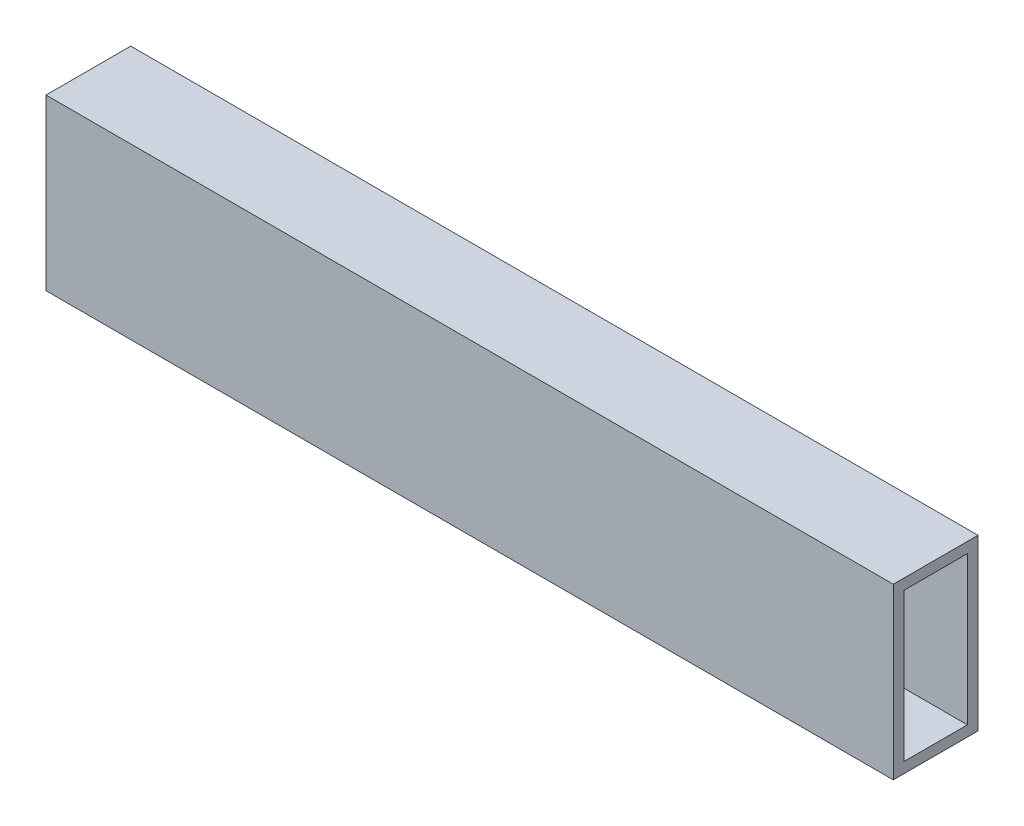
ISO-10303-21;
HEADER;
FILE_DESCRIPTION(('STEP AP214'),'2;1');
FILE_NAME('part.step','',(''),(''),'','','');
FILE_SCHEMA(('AUTOMOTIVE_DESIGN { 1 0 10303 214 1 1 1 1 }'));
ENDSEC;
DATA;
#1=APPLICATION_CONTEXT('core data for automotive mechanical design processes');
#2=APPLICATION_PROTOCOL_DEFINITION('international standard','automotive_design',2000,#1);
#3=PRODUCT_CONTEXT('',#1,'mechanical');
#4=PRODUCT('Part','Part','',(#3));
#5=PRODUCT_RELATED_PRODUCT_CATEGORY('part','',(#4));
#6=PRODUCT_DEFINITION_FORMATION('','',#4);
#7=PRODUCT_DEFINITION_CONTEXT('part definition',#1,'design');
#8=PRODUCT_DEFINITION('design','',#6,#7);
#9=PRODUCT_DEFINITION_SHAPE('','',#8);
#10=(LENGTH_UNIT() NAMED_UNIT(*) SI_UNIT(.MILLI.,.METRE.));
#11=(NAMED_UNIT(*) PLANE_ANGLE_UNIT() SI_UNIT($,.RADIAN.));
#12=(NAMED_UNIT(*) SI_UNIT($,.STERADIAN.) SOLID_ANGLE_UNIT());
#13=UNCERTAINTY_MEASURE_WITH_UNIT(LENGTH_MEASURE(1.E-05),#10,'distance_accuracy_value','');
#14=(GEOMETRIC_REPRESENTATION_CONTEXT(3) GLOBAL_UNCERTAINTY_ASSIGNED_CONTEXT((#13)) GLOBAL_UNIT_ASSIGNED_CONTEXT((#10,
#11,#12)) REPRESENTATION_CONTEXT('',''));
#15=CARTESIAN_POINT('',(0.,0.,0.));
#16=DIRECTION('',(0.,0.,1.));
#17=DIRECTION('',(1.,0.,0.));
#18=AXIS2_PLACEMENT_3D('',#15,#16,#17);
#19=CARTESIAN_POINT('',(127.,25.4,-12.7));
#20=DIRECTION('',(-1.,0.,0.));
#21=DIRECTION('',(0.,0.,1.));
#22=AXIS2_PLACEMENT_3D('',#19,#20,#21);
#23=PLANE('',#22);
#24=DIRECTION('',(0.,0.,-1.));
#25=VECTOR('',#24,1.);
#26=CARTESIAN_POINT('',(127.,-25.4,-12.7));
#27=LINE('',#26,#25);
#28=CARTESIAN_POINT('',(127.,-25.4,12.7));
#29=VERTEX_POINT('',#28);
#30=CARTESIAN_POINT('',(127.,-25.4,-12.7));
#31=VERTEX_POINT('',#30);
#32=EDGE_CURVE('E129',#29,#31,#27,.T.);
#33=ORIENTED_EDGE('',*,*,#32,.T.);
#34=DIRECTION('',(0.,-1.,0.));
#35=VECTOR('',#34,1.);
#36=CARTESIAN_POINT('',(127.,25.4,-12.7));
#37=LINE('',#36,#35);
#38=CARTESIAN_POINT('',(127.,25.4,-12.7));
#39=VERTEX_POINT('',#38);
#40=EDGE_CURVE('E11',#39,#31,#37,.T.);
#41=ORIENTED_EDGE('',*,*,#40,.F.);
#42=DIRECTION('',(0.,0.,-1.));
#43=VECTOR('',#42,1.);
#44=CARTESIAN_POINT('',(127.,25.4,-12.7));
#45=LINE('',#44,#43);
#46=CARTESIAN_POINT('',(127.,25.4,12.7));
#47=VERTEX_POINT('',#46);
#48=EDGE_CURVE('E134',#47,#39,#45,.T.);
#49=ORIENTED_EDGE('',*,*,#48,.F.);
#50=DIRECTION('',(0.,-1.,0.));
#51=VECTOR('',#50,1.);
#52=CARTESIAN_POINT('',(127.,25.4,12.7));
#53=LINE('',#52,#51);
#54=EDGE_CURVE('E144',#47,#29,#53,.T.);
#55=ORIENTED_EDGE('',*,*,#54,.T.);
#56=EDGE_LOOP('',(#33,#41,#49,#55));
#57=FACE_BOUND('',#56,.T.);
#58=DIRECTION('',(0.,0.,-1.));
#59=VECTOR('',#58,1.);
#60=CARTESIAN_POINT('',(127.,-22.225,-12.7));
#61=LINE('',#60,#59);
#62=CARTESIAN_POINT('',(127.,-22.225,9.525));
#63=VERTEX_POINT('',#62);
#64=CARTESIAN_POINT('',(127.,-22.225,-9.525));
#65=VERTEX_POINT('',#64);
#66=EDGE_CURVE('E105',#63,#65,#61,.T.);
#67=ORIENTED_EDGE('',*,*,#66,.F.);
#68=DIRECTION('',(0.,-1.,0.));
#69=VECTOR('',#68,1.);
#70=CARTESIAN_POINT('',(127.,25.4,9.525));
#71=LINE('',#70,#69);
#72=CARTESIAN_POINT('',(127.,22.225,9.525));
#73=VERTEX_POINT('',#72);
#74=EDGE_CURVE('E125',#73,#63,#71,.T.);
#75=ORIENTED_EDGE('',*,*,#74,.F.);
#76=DIRECTION('',(0.,0.,-1.));
#77=VECTOR('',#76,1.);
#78=CARTESIAN_POINT('',(127.,22.225,-12.7));
#79=LINE('',#78,#77);
#80=CARTESIAN_POINT('',(127.,22.225,-9.525));
#81=VERTEX_POINT('',#80);
#82=EDGE_CURVE('E49',#73,#81,#79,.T.);
#83=ORIENTED_EDGE('',*,*,#82,.T.);
#84=DIRECTION('',(0.,-1.,0.));
#85=VECTOR('',#84,1.);
#86=CARTESIAN_POINT('',(127.,25.4,-9.525));
#87=LINE('',#86,#85);
#88=EDGE_CURVE('E115',#81,#65,#87,.T.);
#89=ORIENTED_EDGE('',*,*,#88,.T.);
#90=EDGE_LOOP('',(#67,#75,#83,#89));
#91=FACE_BOUND('',#90,.T.);
#92=ADVANCED_FACE('F35',(#57,#91),#23,.F.);
#93=CARTESIAN_POINT('',(-127.,25.4,-12.7));
#94=DIRECTION('',(1.,0.,0.));
#95=DIRECTION('',(0.,0.,-1.));
#96=AXIS2_PLACEMENT_3D('',#93,#94,#95);
#97=PLANE('',#96);
#98=DIRECTION('',(0.,0.,1.));
#99=VECTOR('',#98,1.);
#100=CARTESIAN_POINT('',(-127.,-25.4,-12.7));
#101=LINE('',#100,#99);
#102=CARTESIAN_POINT('',(-127.,-25.4,-12.7));
#103=VERTEX_POINT('',#102);
#104=CARTESIAN_POINT('',(-127.,-25.4,12.7));
#105=VERTEX_POINT('',#104);
#106=EDGE_CURVE('E149',#103,#105,#101,.T.);
#107=ORIENTED_EDGE('',*,*,#106,.T.);
#108=DIRECTION('',(0.,-1.,0.));
#109=VECTOR('',#108,1.);
#110=CARTESIAN_POINT('',(-127.,25.4,12.7));
#111=LINE('',#110,#109);
#112=CARTESIAN_POINT('',(-127.,25.4,12.7));
#113=VERTEX_POINT('',#112);
#114=EDGE_CURVE('E154',#113,#105,#111,.T.);
#115=ORIENTED_EDGE('',*,*,#114,.F.);
#116=DIRECTION('',(0.,0.,1.));
#117=VECTOR('',#116,1.);
#118=CARTESIAN_POINT('',(-127.,25.4,-12.7));
#119=LINE('',#118,#117);
#120=CARTESIAN_POINT('',(-127.,25.4,-12.7));
#121=VERTEX_POINT('',#120);
#122=EDGE_CURVE('E140',#121,#113,#119,.T.);
#123=ORIENTED_EDGE('',*,*,#122,.F.);
#124=DIRECTION('',(0.,-1.,0.));
#125=VECTOR('',#124,1.);
#126=CARTESIAN_POINT('',(-127.,25.4,-12.7));
#127=LINE('',#126,#125);
#128=EDGE_CURVE('E42',#121,#103,#127,.T.);
#129=ORIENTED_EDGE('',*,*,#128,.T.);
#130=EDGE_LOOP('',(#107,#115,#123,#129));
#131=FACE_BOUND('',#130,.T.);
#132=DIRECTION('',(0.,0.,1.));
#133=VECTOR('',#132,1.);
#134=CARTESIAN_POINT('',(-127.,-22.225,-12.7));
#135=LINE('',#134,#133);
#136=CARTESIAN_POINT('',(-127.,-22.225,-9.525));
#137=VERTEX_POINT('',#136);
#138=CARTESIAN_POINT('',(-127.,-22.225,9.525));
#139=VERTEX_POINT('',#138);
#140=EDGE_CURVE('E102',#137,#139,#135,.T.);
#141=ORIENTED_EDGE('',*,*,#140,.F.);
#142=DIRECTION('',(0.,-1.,0.));
#143=VECTOR('',#142,1.);
#144=CARTESIAN_POINT('',(-127.,25.4,-9.525));
#145=LINE('',#144,#143);
#146=CARTESIAN_POINT('',(-127.,22.225,-9.525));
#147=VERTEX_POINT('',#146);
#148=EDGE_CURVE('E111',#147,#137,#145,.T.);
#149=ORIENTED_EDGE('',*,*,#148,.F.);
#150=DIRECTION('',(0.,0.,1.));
#151=VECTOR('',#150,1.);
#152=CARTESIAN_POINT('',(-127.,22.225,-12.7));
#153=LINE('',#152,#151);
#154=CARTESIAN_POINT('',(-127.,22.225,9.525));
#155=VERTEX_POINT('',#154);
#156=EDGE_CURVE('E54',#147,#155,#153,.T.);
#157=ORIENTED_EDGE('',*,*,#156,.T.);
#158=DIRECTION('',(0.,-1.,0.));
#159=VECTOR('',#158,1.);
#160=CARTESIAN_POINT('',(-127.,25.4,9.525));
#161=LINE('',#160,#159);
#162=EDGE_CURVE('E116',#155,#139,#161,.T.);
#163=ORIENTED_EDGE('',*,*,#162,.T.);
#164=EDGE_LOOP('',(#141,#149,#157,#163));
#165=FACE_BOUND('',#164,.T.);
#166=ADVANCED_FACE('F119',(#131,#165),#97,.F.);
#167=CARTESIAN_POINT('',(-127.,25.4,-12.7));
#168=DIRECTION('',(0.,0.,1.));
#169=DIRECTION('',(1.,0.,0.));
#170=AXIS2_PLACEMENT_3D('',#167,#168,#169);
#171=PLANE('',#170);
#172=DIRECTION('',(-1.,0.,0.));
#173=VECTOR('',#172,1.);
#174=CARTESIAN_POINT('',(-127.,-25.4,-12.7));
#175=LINE('',#174,#173);
#176=EDGE_CURVE('E147',#31,#103,#175,.T.);
#177=ORIENTED_EDGE('',*,*,#176,.T.);
#178=ORIENTED_EDGE('',*,*,#128,.F.);
#179=DIRECTION('',(-1.,0.,0.));
#180=VECTOR('',#179,1.);
#181=CARTESIAN_POINT('',(-127.,25.4,-12.7));
#182=LINE('',#181,#180);
#183=EDGE_CURVE('E137',#39,#121,#182,.T.);
#184=ORIENTED_EDGE('',*,*,#183,.F.);
#185=ORIENTED_EDGE('',*,*,#40,.T.);
#186=EDGE_LOOP('',(#177,#178,#184,#185));
#187=FACE_BOUND('',#186,.T.);
#188=ADVANCED_FACE('F177',(#187),#171,.F.);
#189=CARTESIAN_POINT('',(-127.,25.4,12.7));
#190=DIRECTION('',(0.,0.,-1.));
#191=DIRECTION('',(-1.,0.,0.));
#192=AXIS2_PLACEMENT_3D('',#189,#190,#191);
#193=PLANE('',#192);
#194=DIRECTION('',(1.,0.,0.));
#195=VECTOR('',#194,1.);
#196=CARTESIAN_POINT('',(-127.,-25.4,12.7));
#197=LINE('',#196,#195);
#198=EDGE_CURVE('E138',#105,#29,#197,.T.);
#199=ORIENTED_EDGE('',*,*,#198,.T.);
#200=ORIENTED_EDGE('',*,*,#54,.F.);
#201=DIRECTION('',(1.,0.,0.));
#202=VECTOR('',#201,1.);
#203=CARTESIAN_POINT('',(-127.,25.4,12.7));
#204=LINE('',#203,#202);
#205=EDGE_CURVE('E142',#113,#47,#204,.T.);
#206=ORIENTED_EDGE('',*,*,#205,.F.);
#207=ORIENTED_EDGE('',*,*,#114,.T.);
#208=EDGE_LOOP('',(#199,#200,#206,#207));
#209=FACE_BOUND('',#208,.T.);
#210=ADVANCED_FACE('F169',(#209),#193,.F.);
#211=CARTESIAN_POINT('',(0.,25.4,0.));
#212=DIRECTION('',(0.,1.,0.));
#213=DIRECTION('',(0.,0.,1.));
#214=AXIS2_PLACEMENT_3D('',#211,#212,#213);
#215=PLANE('',#214);
#216=ORIENTED_EDGE('',*,*,#48,.T.);
#217=ORIENTED_EDGE('',*,*,#183,.T.);
#218=ORIENTED_EDGE('',*,*,#122,.T.);
#219=ORIENTED_EDGE('',*,*,#205,.T.);
#220=EDGE_LOOP('',(#216,#217,#218,#219));
#221=FACE_BOUND('',#220,.T.);
#222=ADVANCED_FACE('F176',(#221),#215,.T.);
#223=CARTESIAN_POINT('',(0.,-25.4,0.));
#224=DIRECTION('',(0.,1.,0.));
#225=DIRECTION('',(0.,0.,1.));
#226=AXIS2_PLACEMENT_3D('',#223,#224,#225);
#227=PLANE('',#226);
#228=ORIENTED_EDGE('',*,*,#32,.F.);
#229=ORIENTED_EDGE('',*,*,#198,.F.);
#230=ORIENTED_EDGE('',*,*,#106,.F.);
#231=ORIENTED_EDGE('',*,*,#176,.F.);
#232=EDGE_LOOP('',(#228,#229,#230,#231));
#233=FACE_BOUND('',#232,.T.);
#234=ADVANCED_FACE('F166',(#233),#227,.F.);
#235=CARTESIAN_POINT('',(-127.,25.4,-9.525));
#236=DIRECTION('',(0.,0.,1.));
#237=DIRECTION('',(1.,0.,0.));
#238=AXIS2_PLACEMENT_3D('',#235,#236,#237);
#239=PLANE('',#238);
#240=DIRECTION('',(-1.,0.,0.));
#241=VECTOR('',#240,1.);
#242=CARTESIAN_POINT('',(-127.,-22.225,-9.525));
#243=LINE('',#242,#241);
#244=EDGE_CURVE('E98',#65,#137,#243,.T.);
#245=ORIENTED_EDGE('',*,*,#244,.F.);
#246=ORIENTED_EDGE('',*,*,#88,.F.);
#247=DIRECTION('',(-1.,0.,0.));
#248=VECTOR('',#247,1.);
#249=CARTESIAN_POINT('',(-127.,22.225,-9.525));
#250=LINE('',#249,#248);
#251=EDGE_CURVE('E113',#81,#147,#250,.T.);
#252=ORIENTED_EDGE('',*,*,#251,.T.);
#253=ORIENTED_EDGE('',*,*,#148,.T.);
#254=EDGE_LOOP('',(#245,#246,#252,#253));
#255=FACE_BOUND('',#254,.T.);
#256=ADVANCED_FACE('F112',(#255),#239,.T.);
#257=CARTESIAN_POINT('',(-127.,25.4,9.525));
#258=DIRECTION('',(0.,0.,-1.));
#259=DIRECTION('',(-1.,0.,0.));
#260=AXIS2_PLACEMENT_3D('',#257,#258,#259);
#261=PLANE('',#260);
#262=DIRECTION('',(1.,0.,0.));
#263=VECTOR('',#262,1.);
#264=CARTESIAN_POINT('',(-127.,-22.225,9.525));
#265=LINE('',#264,#263);
#266=EDGE_CURVE('E120',#139,#63,#265,.T.);
#267=ORIENTED_EDGE('',*,*,#266,.F.);
#268=ORIENTED_EDGE('',*,*,#162,.F.);
#269=DIRECTION('',(1.,0.,0.));
#270=VECTOR('',#269,1.);
#271=CARTESIAN_POINT('',(-127.,22.225,9.525));
#272=LINE('',#271,#270);
#273=EDGE_CURVE('E127',#155,#73,#272,.T.);
#274=ORIENTED_EDGE('',*,*,#273,.T.);
#275=ORIENTED_EDGE('',*,*,#74,.T.);
#276=EDGE_LOOP('',(#267,#268,#274,#275));
#277=FACE_BOUND('',#276,.T.);
#278=ADVANCED_FACE('F203',(#277),#261,.T.);
#279=CARTESIAN_POINT('',(0.,22.225,0.));
#280=DIRECTION('',(0.,1.,0.));
#281=DIRECTION('',(0.,0.,1.));
#282=AXIS2_PLACEMENT_3D('',#279,#280,#281);
#283=PLANE('',#282);
#284=ORIENTED_EDGE('',*,*,#82,.F.);
#285=ORIENTED_EDGE('',*,*,#273,.F.);
#286=ORIENTED_EDGE('',*,*,#156,.F.);
#287=ORIENTED_EDGE('',*,*,#251,.F.);
#288=EDGE_LOOP('',(#284,#285,#286,#287));
#289=FACE_BOUND('',#288,.T.);
#290=ADVANCED_FACE('F213',(#289),#283,.F.);
#291=CARTESIAN_POINT('',(0.,-22.225,0.));
#292=DIRECTION('',(0.,1.,0.));
#293=DIRECTION('',(0.,0.,1.));
#294=AXIS2_PLACEMENT_3D('',#291,#292,#293);
#295=PLANE('',#294);
#296=ORIENTED_EDGE('',*,*,#66,.T.);
#297=ORIENTED_EDGE('',*,*,#244,.T.);
#298=ORIENTED_EDGE('',*,*,#140,.T.);
#299=ORIENTED_EDGE('',*,*,#266,.T.);
#300=EDGE_LOOP('',(#296,#297,#298,#299));
#301=FACE_BOUND('',#300,.T.);
#302=ADVANCED_FACE('F100',(#301),#295,.T.);
#303=CLOSED_SHELL('',(#92,#166,#188,#210,#222,#234,#256,#278,#290,#302));
#304=MANIFOLD_SOLID_BREP('B2',#303);
#305=ADVANCED_BREP_SHAPE_REPRESENTATION('',(#18,#304),#14);
#306=SHAPE_DEFINITION_REPRESENTATION(#9,#305);
ENDSEC;
END-ISO-10303-21;
